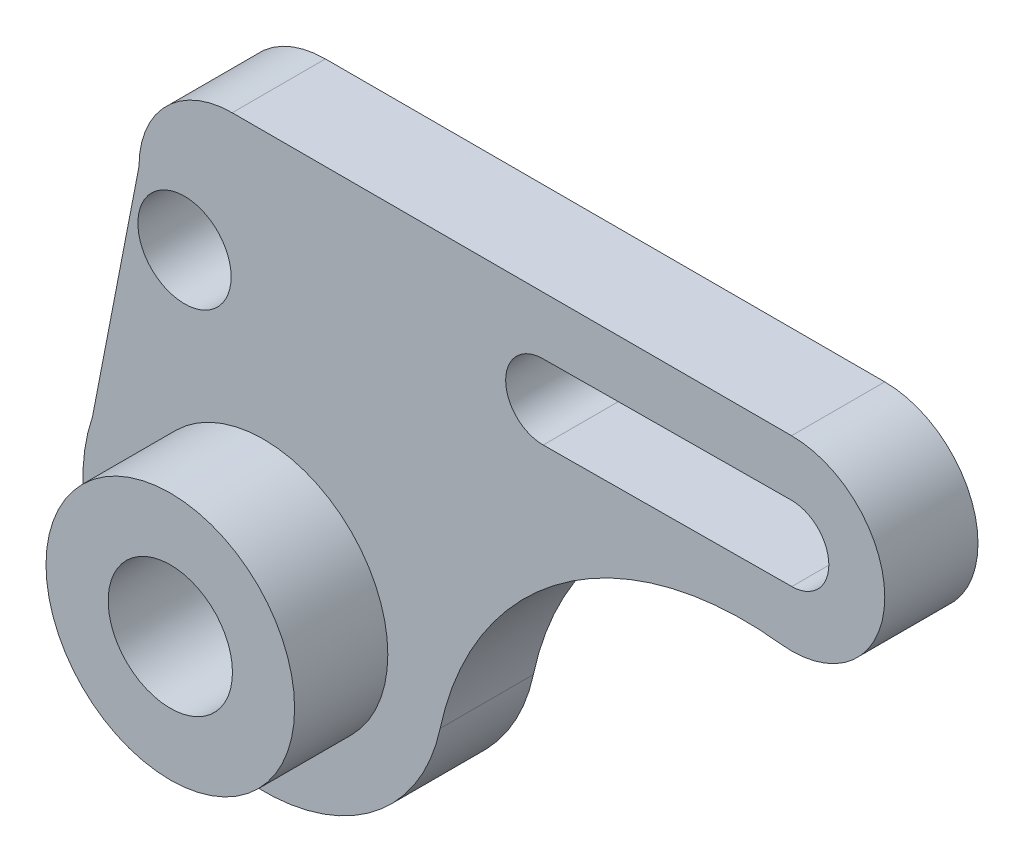
ISO-10303-21;
HEADER;
FILE_DESCRIPTION(('STEP AP214'),'2;1');
FILE_NAME('part.step','',(''),(''),'','','');
FILE_SCHEMA(('AUTOMOTIVE_DESIGN { 1 0 10303 214 1 1 1 1 }'));
ENDSEC;
DATA;
#1=APPLICATION_CONTEXT('core data for automotive mechanical design processes');
#2=APPLICATION_PROTOCOL_DEFINITION('international standard','automotive_design',2000,#1);
#3=PRODUCT_CONTEXT('',#1,'mechanical');
#4=PRODUCT('Part','Part','',(#3));
#5=PRODUCT_RELATED_PRODUCT_CATEGORY('part','',(#4));
#6=PRODUCT_DEFINITION_FORMATION('','',#4);
#7=PRODUCT_DEFINITION_CONTEXT('part definition',#1,'design');
#8=PRODUCT_DEFINITION('design','',#6,#7);
#9=PRODUCT_DEFINITION_SHAPE('','',#8);
#10=(LENGTH_UNIT() NAMED_UNIT(*) SI_UNIT(.MILLI.,.METRE.));
#11=(NAMED_UNIT(*) PLANE_ANGLE_UNIT() SI_UNIT($,.RADIAN.));
#12=(NAMED_UNIT(*) SI_UNIT($,.STERADIAN.) SOLID_ANGLE_UNIT());
#13=UNCERTAINTY_MEASURE_WITH_UNIT(LENGTH_MEASURE(1.E-05),#10,'distance_accuracy_value','');
#14=(GEOMETRIC_REPRESENTATION_CONTEXT(3) GLOBAL_UNCERTAINTY_ASSIGNED_CONTEXT((#13)) GLOBAL_UNIT_ASSIGNED_CONTEXT((#10,
#11,#12)) REPRESENTATION_CONTEXT('',''));
#15=CARTESIAN_POINT('',(0.,0.,0.));
#16=DIRECTION('',(0.,0.,1.));
#17=DIRECTION('',(1.,0.,0.));
#18=AXIS2_PLACEMENT_3D('',#15,#16,#17);
#19=CARTESIAN_POINT('',(0.,0.,50.));
#20=DIRECTION('',(0.,0.,-1.));
#21=DIRECTION('',(-1.,0.,0.));
#22=AXIS2_PLACEMENT_3D('',#19,#20,#21);
#23=CYLINDRICAL_SURFACE('',#22,20.);
#24=CARTESIAN_POINT('',(0.,0.,15.));
#25=DIRECTION('',(0.,0.,1.));
#26=DIRECTION('',(1.,0.,0.));
#27=AXIS2_PLACEMENT_3D('',#24,#25,#26);
#28=CIRCLE('',#27,20.);
#29=CARTESIAN_POINT('',(20.,0.,15.));
#30=VERTEX_POINT('',#29);
#31=EDGE_CURVE('E162',#30,#30,#28,.T.);
#32=ORIENTED_EDGE('',*,*,#31,.T.);
#33=EDGE_LOOP('',(#32));
#34=FACE_BOUND('',#33,.T.);
#35=CARTESIAN_POINT('',(0.,0.,30.));
#36=DIRECTION('',(0.,0.,1.));
#37=DIRECTION('',(1.,0.,0.));
#38=AXIS2_PLACEMENT_3D('',#35,#36,#37);
#39=CIRCLE('',#38,20.);
#40=CARTESIAN_POINT('',(20.,0.,30.));
#41=VERTEX_POINT('',#40);
#42=EDGE_CURVE('E305',#41,#41,#39,.T.);
#43=ORIENTED_EDGE('',*,*,#42,.F.);
#44=EDGE_LOOP('',(#43));
#45=FACE_BOUND('',#44,.T.);
#46=ADVANCED_FACE('F43',(#34,#45),#23,.T.);
#47=CARTESIAN_POINT('',(0.,0.,0.));
#48=DIRECTION('',(0.,0.,1.));
#49=DIRECTION('',(1.,0.,0.));
#50=AXIS2_PLACEMENT_3D('',#47,#48,#49);
#51=CYLINDRICAL_SURFACE('',#50,10.);
#52=CARTESIAN_POINT('',(0.,0.,0.));
#53=DIRECTION('',(0.,0.,1.));
#54=DIRECTION('',(1.,0.,0.));
#55=AXIS2_PLACEMENT_3D('',#52,#53,#54);
#56=CIRCLE('',#55,10.);
#57=CARTESIAN_POINT('',(10.,0.,0.));
#58=VERTEX_POINT('',#57);
#59=EDGE_CURVE('E298',#58,#58,#56,.T.);
#60=ORIENTED_EDGE('',*,*,#59,.F.);
#61=EDGE_LOOP('',(#60));
#62=FACE_BOUND('',#61,.T.);
#63=CARTESIAN_POINT('',(0.,0.,30.));
#64=DIRECTION('',(0.,0.,1.));
#65=DIRECTION('',(1.,0.,0.));
#66=AXIS2_PLACEMENT_3D('',#63,#64,#65);
#67=CIRCLE('',#66,10.);
#68=CARTESIAN_POINT('',(10.,0.,30.));
#69=VERTEX_POINT('',#68);
#70=EDGE_CURVE('E47',#69,#69,#67,.F.);
#71=ORIENTED_EDGE('',*,*,#70,.F.);
#72=EDGE_LOOP('',(#71));
#73=FACE_BOUND('',#72,.T.);
#74=ADVANCED_FACE('F273',(#62,#73),#51,.F.);
#75=CARTESIAN_POINT('',(84.9581360849498,47.9634932344321,15.));
#76=DIRECTION('',(0.,0.,-1.));
#77=DIRECTION('',(-1.,0.,0.));
#78=AXIS2_PLACEMENT_3D('',#75,#76,#77);
#79=CYLINDRICAL_SURFACE('',#78,6.);
#80=CARTESIAN_POINT('',(84.9581360849498,47.9634932344321,0.));
#81=DIRECTION('',(0.,0.,1.));
#82=DIRECTION('',(1.,0.,0.));
#83=AXIS2_PLACEMENT_3D('',#80,#81,#82);
#84=CIRCLE('',#83,6.);
#85=CARTESIAN_POINT('',(85.,41.9636392851583,0.));
#86=VERTEX_POINT('',#85);
#87=CARTESIAN_POINT('',(84.9162721698997,53.963347183706,0.));
#88=VERTEX_POINT('',#87);
#89=EDGE_CURVE('E180',#86,#88,#84,.T.);
#90=ORIENTED_EDGE('',*,*,#89,.F.);
#91=DIRECTION('',(0.,0.,-1.));
#92=VECTOR('',#91,1.);
#93=CARTESIAN_POINT('',(85.,41.9636392851583,15.));
#94=LINE('',#93,#92);
#95=CARTESIAN_POINT('',(85.,41.9636392851583,15.));
#96=VERTEX_POINT('',#95);
#97=EDGE_CURVE('E11',#96,#86,#94,.T.);
#98=ORIENTED_EDGE('',*,*,#97,.F.);
#99=CARTESIAN_POINT('',(84.9581360849498,47.9634932344321,15.));
#100=DIRECTION('',(0.,0.,1.));
#101=DIRECTION('',(1.,0.,0.));
#102=AXIS2_PLACEMENT_3D('',#99,#100,#101);
#103=CIRCLE('',#102,6.);
#104=CARTESIAN_POINT('',(84.9162721698997,53.963347183706,15.));
#105=VERTEX_POINT('',#104);
#106=EDGE_CURVE('E146',#96,#105,#103,.T.);
#107=ORIENTED_EDGE('',*,*,#106,.T.);
#108=DIRECTION('',(0.,0.,-1.));
#109=VECTOR('',#108,1.);
#110=CARTESIAN_POINT('',(84.9162721698997,53.963347183706,15.));
#111=LINE('',#110,#109);
#112=EDGE_CURVE('E103',#105,#88,#111,.T.);
#113=ORIENTED_EDGE('',*,*,#112,.T.);
#114=EDGE_LOOP('',(#90,#98,#107,#113));
#115=FACE_BOUND('',#114,.T.);
#116=ADVANCED_FACE('F259',(#115),#79,.F.);
#117=CARTESIAN_POINT('',(-0.288648524371985,41.3685386765846,15.));
#118=DIRECTION('',(-0.00697731917502474,0.999975658212304,0.));
#119=DIRECTION('',(-0.999975658212304,-0.00697731917502474,0.));
#120=AXIS2_PLACEMENT_3D('',#117,#118,#119);
#121=PLANE('',#120);
#122=DIRECTION('',(0.999975658212304,0.00697731917502474,0.));
#123=VECTOR('',#122,1.);
#124=CARTESIAN_POINT('',(-0.288648524371985,41.3685386765846,0.));
#125=LINE('',#124,#123);
#126=CARTESIAN_POINT('',(45.,41.6845397243751,0.));
#127=VERTEX_POINT('',#126);
#128=EDGE_CURVE('E137',#127,#86,#125,.T.);
#129=ORIENTED_EDGE('',*,*,#128,.F.);
#130=DIRECTION('',(0.,0.,-1.));
#131=VECTOR('',#130,1.);
#132=CARTESIAN_POINT('',(45.,41.6845397243751,15.));
#133=LINE('',#132,#131);
#134=CARTESIAN_POINT('',(45.,41.6845397243751,15.));
#135=VERTEX_POINT('',#134);
#136=EDGE_CURVE('E54',#135,#127,#133,.T.);
#137=ORIENTED_EDGE('',*,*,#136,.F.);
#138=DIRECTION('',(0.999975658212304,0.00697731917502474,0.));
#139=VECTOR('',#138,1.);
#140=CARTESIAN_POINT('',(-0.288648524371985,41.3685386765846,15.));
#141=LINE('',#140,#139);
#142=EDGE_CURVE('E135',#135,#96,#141,.T.);
#143=ORIENTED_EDGE('',*,*,#142,.T.);
#144=ORIENTED_EDGE('',*,*,#97,.T.);
#145=EDGE_LOOP('',(#129,#137,#143,#144));
#146=FACE_BOUND('',#145,.T.);
#147=ADVANCED_FACE('F134',(#146),#121,.T.);
#148=CARTESIAN_POINT('',(44.9581360849499,47.6843936736489,15.));
#149=DIRECTION('',(0.,0.,-1.));
#150=DIRECTION('',(-1.,0.,0.));
#151=AXIS2_PLACEMENT_3D('',#148,#149,#150);
#152=CYLINDRICAL_SURFACE('',#151,6.);
#153=CARTESIAN_POINT('',(44.9581360849499,47.6843936736489,0.));
#154=DIRECTION('',(0.,0.,1.));
#155=DIRECTION('',(1.,0.,0.));
#156=AXIS2_PLACEMENT_3D('',#153,#154,#155);
#157=CIRCLE('',#156,6.);
#158=CARTESIAN_POINT('',(44.9162721698997,53.6842476229227,0.));
#159=VERTEX_POINT('',#158);
#160=EDGE_CURVE('E186',#159,#127,#157,.T.);
#161=ORIENTED_EDGE('',*,*,#160,.F.);
#162=DIRECTION('',(0.,0.,-1.));
#163=VECTOR('',#162,1.);
#164=CARTESIAN_POINT('',(44.9162721698997,53.6842476229227,15.));
#165=LINE('',#164,#163);
#166=CARTESIAN_POINT('',(44.9162721698997,53.6842476229227,15.));
#167=VERTEX_POINT('',#166);
#168=EDGE_CURVE('E96',#167,#159,#165,.T.);
#169=ORIENTED_EDGE('',*,*,#168,.F.);
#170=CARTESIAN_POINT('',(44.9581360849499,47.6843936736489,15.));
#171=DIRECTION('',(0.,0.,1.));
#172=DIRECTION('',(1.,0.,0.));
#173=AXIS2_PLACEMENT_3D('',#170,#171,#172);
#174=CIRCLE('',#173,6.);
#175=EDGE_CURVE('E145',#167,#135,#174,.T.);
#176=ORIENTED_EDGE('',*,*,#175,.T.);
#177=ORIENTED_EDGE('',*,*,#136,.T.);
#178=EDGE_LOOP('',(#161,#169,#176,#177));
#179=FACE_BOUND('',#178,.T.);
#180=ADVANCED_FACE('F149',(#179),#152,.F.);
#181=CARTESIAN_POINT('',(77.3075452454022,-16.584693880357,15.));
#182=DIRECTION('',(0.,0.,-1.));
#183=DIRECTION('',(-1.,0.,0.));
#184=AXIS2_PLACEMENT_3D('',#181,#182,#183);
#185=CYLINDRICAL_SURFACE('',#184,50.);
#186=CARTESIAN_POINT('',(77.3075452454022,-16.584693880357,0.));
#187=DIRECTION('',(0.,0.,1.));
#188=DIRECTION('',(1.,0.,0.));
#189=AXIS2_PLACEMENT_3D('',#186,#187,#188);
#190=CIRCLE('',#189,50.);
#191=CARTESIAN_POINT('',(83.1926151219773,33.0677577464039,0.));
#192=VERTEX_POINT('',#191);
#193=CARTESIAN_POINT('',(28.419860477752,-6.09687818504373,0.));
#194=VERTEX_POINT('',#193);
#195=EDGE_CURVE('E157',#192,#194,#190,.T.);
#196=ORIENTED_EDGE('',*,*,#195,.F.);
#197=DIRECTION('',(0.,0.,-1.));
#198=VECTOR('',#197,1.);
#199=CARTESIAN_POINT('',(83.1926151219773,33.0677577464039,15.));
#200=LINE('',#199,#198);
#201=CARTESIAN_POINT('',(83.1926151219773,33.0677577464039,15.));
#202=VERTEX_POINT('',#201);
#203=EDGE_CURVE('E110',#202,#192,#200,.T.);
#204=ORIENTED_EDGE('',*,*,#203,.F.);
#205=CARTESIAN_POINT('',(77.3075452454022,-16.584693880357,15.));
#206=DIRECTION('',(0.,0.,1.));
#207=DIRECTION('',(1.,0.,0.));
#208=AXIS2_PLACEMENT_3D('',#205,#206,#207);
#209=CIRCLE('',#208,50.);
#210=CARTESIAN_POINT('',(28.419860477752,-6.09687818504373,15.));
#211=VERTEX_POINT('',#210);
#212=EDGE_CURVE('E192',#202,#211,#209,.T.);
#213=ORIENTED_EDGE('',*,*,#212,.T.);
#214=DIRECTION('',(0.,0.,-1.));
#215=VECTOR('',#214,1.);
#216=CARTESIAN_POINT('',(28.419860477752,-6.09687818504373,15.));
#217=LINE('',#216,#215);
#218=EDGE_CURVE('E153',#211,#194,#217,.T.);
#219=ORIENTED_EDGE('',*,*,#218,.T.);
#220=EDGE_LOOP('',(#196,#204,#213,#219));
#221=FACE_BOUND('',#220,.T.);
#222=ADVANCED_FACE('F45',(#221),#185,.F.);
#223=CARTESIAN_POINT('',(84.9581360849498,47.9634932344321,15.));
#224=DIRECTION('',(0.,0.,-1.));
#225=DIRECTION('',(-1.,0.,0.));
#226=AXIS2_PLACEMENT_3D('',#223,#224,#225);
#227=CYLINDRICAL_SURFACE('',#226,15.);
#228=CARTESIAN_POINT('',(84.9581360849498,47.9634932344321,0.));
#229=DIRECTION('',(0.,0.,1.));
#230=DIRECTION('',(1.,0.,0.));
#231=AXIS2_PLACEMENT_3D('',#228,#229,#230);
#232=CIRCLE('',#231,15.);
#233=CARTESIAN_POINT('',(84.9581360849498,62.9634932344321,0.));
#234=VERTEX_POINT('',#233);
#235=EDGE_CURVE('E161',#192,#234,#232,.T.);
#236=ORIENTED_EDGE('',*,*,#235,.T.);
#237=DIRECTION('',(0.,0.,-1.));
#238=VECTOR('',#237,1.);
#239=CARTESIAN_POINT('',(84.9581360849498,62.9634932344321,15.));
#240=LINE('',#239,#238);
#241=CARTESIAN_POINT('',(84.9581360849498,62.9634932344321,15.));
#242=VERTEX_POINT('',#241);
#243=EDGE_CURVE('E210',#242,#234,#240,.T.);
#244=ORIENTED_EDGE('',*,*,#243,.F.);
#245=CARTESIAN_POINT('',(84.9581360849498,47.9634932344321,15.));
#246=DIRECTION('',(0.,0.,1.));
#247=DIRECTION('',(1.,0.,0.));
#248=AXIS2_PLACEMENT_3D('',#245,#246,#247);
#249=CIRCLE('',#248,15.);
#250=EDGE_CURVE('E217',#202,#242,#249,.T.);
#251=ORIENTED_EDGE('',*,*,#250,.F.);
#252=ORIENTED_EDGE('',*,*,#203,.T.);
#253=EDGE_LOOP('',(#236,#244,#251,#252));
#254=FACE_BOUND('',#253,.T.);
#255=ADVANCED_FACE('F215',(#254),#227,.T.);
#256=CARTESIAN_POINT('',(0.,62.9634932344321,15.));
#257=DIRECTION('',(0.,1.,0.));
#258=DIRECTION('',(0.,0.,1.));
#259=AXIS2_PLACEMENT_3D('',#256,#257,#258);
#260=PLANE('',#259);
#261=DIRECTION('',(1.,0.,0.));
#262=VECTOR('',#261,1.);
#263=CARTESIAN_POINT('',(0.,62.9634932344321,0.));
#264=LINE('',#263,#262);
#265=CARTESIAN_POINT('',(-5.04186391505014,62.9634932344321,0.));
#266=VERTEX_POINT('',#265);
#267=EDGE_CURVE('E166',#266,#234,#264,.T.);
#268=ORIENTED_EDGE('',*,*,#267,.F.);
#269=DIRECTION('',(0.,0.,-1.));
#270=VECTOR('',#269,1.);
#271=CARTESIAN_POINT('',(-5.04186391505014,62.9634932344321,15.));
#272=LINE('',#271,#270);
#273=CARTESIAN_POINT('',(-5.04186391505014,62.9634932344321,15.));
#274=VERTEX_POINT('',#273);
#275=EDGE_CURVE('E207',#274,#266,#272,.T.);
#276=ORIENTED_EDGE('',*,*,#275,.F.);
#277=DIRECTION('',(1.,0.,0.));
#278=VECTOR('',#277,1.);
#279=CARTESIAN_POINT('',(0.,62.9634932344321,15.));
#280=LINE('',#279,#278);
#281=EDGE_CURVE('E244',#274,#242,#280,.T.);
#282=ORIENTED_EDGE('',*,*,#281,.T.);
#283=ORIENTED_EDGE('',*,*,#243,.T.);
#284=EDGE_LOOP('',(#268,#276,#282,#283));
#285=FACE_BOUND('',#284,.T.);
#286=ADVANCED_FACE('F243',(#285),#260,.T.);
#287=CARTESIAN_POINT('',(-5.04186391505014,47.9634932344321,15.));
#288=DIRECTION('',(0.,0.,-1.));
#289=DIRECTION('',(-1.,0.,0.));
#290=AXIS2_PLACEMENT_3D('',#287,#288,#289);
#291=CYLINDRICAL_SURFACE('',#290,15.);
#292=CARTESIAN_POINT('',(-5.04186391505014,47.9634932344321,0.));
#293=DIRECTION('',(0.,0.,1.));
#294=DIRECTION('',(1.,0.,0.));
#295=AXIS2_PLACEMENT_3D('',#292,#293,#294);
#296=CIRCLE('',#295,15.);
#297=CARTESIAN_POINT('',(-20.0418639150501,47.9634932344321,0.));
#298=VERTEX_POINT('',#297);
#299=EDGE_CURVE('E170',#266,#298,#296,.T.);
#300=ORIENTED_EDGE('',*,*,#299,.T.);
#301=DIRECTION('',(0.,0.,-1.));
#302=VECTOR('',#301,1.);
#303=CARTESIAN_POINT('',(-20.0418639150501,47.9634932344321,15.));
#304=LINE('',#303,#302);
#305=CARTESIAN_POINT('',(-20.0418639150501,47.9634932344321,15.));
#306=VERTEX_POINT('',#305);
#307=EDGE_CURVE('E203',#306,#298,#304,.T.);
#308=ORIENTED_EDGE('',*,*,#307,.F.);
#309=CARTESIAN_POINT('',(-5.04186391505014,47.9634932344321,15.));
#310=DIRECTION('',(0.,0.,1.));
#311=DIRECTION('',(1.,0.,0.));
#312=AXIS2_PLACEMENT_3D('',#309,#310,#311);
#313=CIRCLE('',#312,15.);
#314=EDGE_CURVE('E239',#274,#306,#313,.T.);
#315=ORIENTED_EDGE('',*,*,#314,.F.);
#316=ORIENTED_EDGE('',*,*,#275,.T.);
#317=EDGE_LOOP('',(#300,#308,#315,#316));
#318=FACE_BOUND('',#317,.T.);
#319=ADVANCED_FACE('F238',(#318),#291,.T.);
#320=CARTESIAN_POINT('',(-28.274150504545,5.47868576814494,15.));
#321=DIRECTION('',(0.981739215628397,-0.190231733675905,0.));
#322=DIRECTION('',(0.190231733675905,0.981739215628397,0.));
#323=AXIS2_PLACEMENT_3D('',#320,#321,#322);
#324=PLANE('',#323);
#325=DIRECTION('',(-0.190231733675905,-0.981739215628397,0.));
#326=VECTOR('',#325,1.);
#327=CARTESIAN_POINT('',(-28.274150504545,5.47868576814494,0.));
#328=LINE('',#327,#326);
#329=CARTESIAN_POINT('',(-27.527219981133,9.33341059251447,0.));
#330=VERTEX_POINT('',#329);
#331=EDGE_CURVE('E173',#298,#330,#328,.T.);
#332=ORIENTED_EDGE('',*,*,#331,.T.);
#333=DIRECTION('',(0.,0.,-1.));
#334=VECTOR('',#333,1.);
#335=CARTESIAN_POINT('',(-27.527219981133,9.33341059251447,15.));
#336=LINE('',#335,#334);
#337=CARTESIAN_POINT('',(-27.527219981133,9.33341059251447,15.));
#338=VERTEX_POINT('',#337);
#339=EDGE_CURVE('E199',#338,#330,#336,.T.);
#340=ORIENTED_EDGE('',*,*,#339,.F.);
#341=DIRECTION('',(-0.190231733675905,-0.981739215628397,0.));
#342=VECTOR('',#341,1.);
#343=CARTESIAN_POINT('',(-28.274150504545,5.47868576814494,15.));
#344=LINE('',#343,#342);
#345=EDGE_CURVE('E235',#306,#338,#344,.T.);
#346=ORIENTED_EDGE('',*,*,#345,.F.);
#347=ORIENTED_EDGE('',*,*,#307,.T.);
#348=EDGE_LOOP('',(#332,#340,#346,#347));
#349=FACE_BOUND('',#348,.T.);
#350=ADVANCED_FACE('F232',(#349),#324,.F.);
#351=CARTESIAN_POINT('',(0.,0.,15.));
#352=DIRECTION('',(0.,0.,-1.));
#353=DIRECTION('',(-1.,0.,0.));
#354=AXIS2_PLACEMENT_3D('',#351,#352,#353);
#355=CYLINDRICAL_SURFACE('',#354,29.0664822979691);
#356=CARTESIAN_POINT('',(0.,0.,0.));
#357=DIRECTION('',(0.,0.,1.));
#358=DIRECTION('',(1.,0.,0.));
#359=AXIS2_PLACEMENT_3D('',#356,#357,#358);
#360=CIRCLE('',#359,29.0664822979691);
#361=EDGE_CURVE('E176',#330,#194,#360,.T.);
#362=ORIENTED_EDGE('',*,*,#361,.T.);
#363=ORIENTED_EDGE('',*,*,#218,.F.);
#364=CARTESIAN_POINT('',(0.,0.,15.));
#365=DIRECTION('',(0.,0.,1.));
#366=DIRECTION('',(1.,0.,0.));
#367=AXIS2_PLACEMENT_3D('',#364,#365,#366);
#368=CIRCLE('',#367,29.0664822979691);
#369=EDGE_CURVE('E256',#338,#211,#368,.T.);
#370=ORIENTED_EDGE('',*,*,#369,.F.);
#371=ORIENTED_EDGE('',*,*,#339,.T.);
#372=EDGE_LOOP('',(#362,#363,#370,#371));
#373=FACE_BOUND('',#372,.T.);
#374=ADVANCED_FACE('F228',(#373),#355,.T.);
#375=CARTESIAN_POINT('',(-0.372376354472282,53.3682465751323,15.));
#376=DIRECTION('',(-0.00697731917502474,0.999975658212304,0.));
#377=DIRECTION('',(-0.999975658212304,-0.00697731917502474,0.));
#378=AXIS2_PLACEMENT_3D('',#375,#376,#377);
#379=PLANE('',#378);
#380=DIRECTION('',(0.999975658212304,0.00697731917502474,0.));
#381=VECTOR('',#380,1.);
#382=CARTESIAN_POINT('',(-0.372376354472282,53.3682465751323,0.));
#383=LINE('',#382,#381);
#384=EDGE_CURVE('E189',#159,#88,#383,.T.);
#385=ORIENTED_EDGE('',*,*,#384,.T.);
#386=ORIENTED_EDGE('',*,*,#112,.F.);
#387=DIRECTION('',(0.999975658212304,0.00697731917502474,0.));
#388=VECTOR('',#387,1.);
#389=CARTESIAN_POINT('',(-0.372376354472282,53.3682465751323,15.));
#390=LINE('',#389,#388);
#391=EDGE_CURVE('E63',#167,#105,#390,.T.);
#392=ORIENTED_EDGE('',*,*,#391,.F.);
#393=ORIENTED_EDGE('',*,*,#168,.T.);
#394=EDGE_LOOP('',(#385,#386,#392,#393));
#395=FACE_BOUND('',#394,.T.);
#396=ADVANCED_FACE('F260',(#395),#379,.F.);
#397=CARTESIAN_POINT('',(0.,0.,15.));
#398=DIRECTION('',(0.,0.,1.));
#399=DIRECTION('',(1.,0.,0.));
#400=AXIS2_PLACEMENT_3D('',#397,#398,#399);
#401=PLANE('',#400);
#402=CARTESIAN_POINT('',(-12.716641071572,40.,15.));
#403=DIRECTION('',(0.,0.,1.));
#404=DIRECTION('',(1.,0.,0.));
#405=AXIS2_PLACEMENT_3D('',#402,#403,#404);
#406=CIRCLE('',#405,7.5);
#407=CARTESIAN_POINT('',(-5.21664107157199,40.,15.));
#408=VERTEX_POINT('',#407);
#409=EDGE_CURVE('E311',#408,#408,#406,.T.);
#410=ORIENTED_EDGE('',*,*,#409,.F.);
#411=EDGE_LOOP('',(#410));
#412=FACE_BOUND('',#411,.T.);
#413=ORIENTED_EDGE('',*,*,#31,.F.);
#414=EDGE_LOOP('',(#413));
#415=FACE_BOUND('',#414,.T.);
#416=ORIENTED_EDGE('',*,*,#212,.F.);
#417=ORIENTED_EDGE('',*,*,#250,.T.);
#418=ORIENTED_EDGE('',*,*,#281,.F.);
#419=ORIENTED_EDGE('',*,*,#314,.T.);
#420=ORIENTED_EDGE('',*,*,#345,.T.);
#421=ORIENTED_EDGE('',*,*,#369,.T.);
#422=EDGE_LOOP('',(#416,#417,#418,#419,#420,#421));
#423=FACE_BOUND('',#422,.T.);
#424=ORIENTED_EDGE('',*,*,#106,.F.);
#425=ORIENTED_EDGE('',*,*,#142,.F.);
#426=ORIENTED_EDGE('',*,*,#175,.F.);
#427=ORIENTED_EDGE('',*,*,#391,.T.);
#428=EDGE_LOOP('',(#424,#425,#426,#427));
#429=FACE_BOUND('',#428,.T.);
#430=ADVANCED_FACE('F144',(#412,#415,#423,#429),#401,.T.);
#431=CARTESIAN_POINT('',(0.,0.,0.));
#432=DIRECTION('',(0.,0.,1.));
#433=DIRECTION('',(1.,0.,0.));
#434=AXIS2_PLACEMENT_3D('',#431,#432,#433);
#435=PLANE('',#434);
#436=CARTESIAN_POINT('',(-12.716641071572,40.,0.));
#437=DIRECTION('',(0.,0.,1.));
#438=DIRECTION('',(1.,0.,0.));
#439=AXIS2_PLACEMENT_3D('',#436,#437,#438);
#440=CIRCLE('',#439,7.5);
#441=CARTESIAN_POINT('',(-5.21664107157199,40.,0.));
#442=VERTEX_POINT('',#441);
#443=EDGE_CURVE('E295',#442,#442,#440,.T.);
#444=ORIENTED_EDGE('',*,*,#443,.T.);
#445=EDGE_LOOP('',(#444));
#446=FACE_BOUND('',#445,.T.);
#447=ORIENTED_EDGE('',*,*,#59,.T.);
#448=EDGE_LOOP('',(#447));
#449=FACE_BOUND('',#448,.T.);
#450=ORIENTED_EDGE('',*,*,#195,.T.);
#451=ORIENTED_EDGE('',*,*,#361,.F.);
#452=ORIENTED_EDGE('',*,*,#331,.F.);
#453=ORIENTED_EDGE('',*,*,#299,.F.);
#454=ORIENTED_EDGE('',*,*,#267,.T.);
#455=ORIENTED_EDGE('',*,*,#235,.F.);
#456=EDGE_LOOP('',(#450,#451,#452,#453,#454,#455));
#457=FACE_BOUND('',#456,.T.);
#458=ORIENTED_EDGE('',*,*,#89,.T.);
#459=ORIENTED_EDGE('',*,*,#384,.F.);
#460=ORIENTED_EDGE('',*,*,#160,.T.);
#461=ORIENTED_EDGE('',*,*,#128,.T.);
#462=EDGE_LOOP('',(#458,#459,#460,#461));
#463=FACE_BOUND('',#462,.T.);
#464=ADVANCED_FACE('F220',(#446,#449,#457,#463),#435,.F.);
#465=CARTESIAN_POINT('',(0.,0.,30.));
#466=DIRECTION('',(0.,0.,1.));
#467=DIRECTION('',(1.,0.,0.));
#468=AXIS2_PLACEMENT_3D('',#465,#466,#467);
#469=PLANE('',#468);
#470=ORIENTED_EDGE('',*,*,#42,.T.);
#471=EDGE_LOOP('',(#470));
#472=FACE_BOUND('',#471,.T.);
#473=ORIENTED_EDGE('',*,*,#70,.T.);
#474=EDGE_LOOP('',(#473));
#475=FACE_BOUND('',#474,.T.);
#476=ADVANCED_FACE('F285',(#472,#475),#469,.T.);
#477=CARTESIAN_POINT('',(-12.716641071572,40.,0.));
#478=DIRECTION('',(0.,0.,1.));
#479=DIRECTION('',(1.,0.,0.));
#480=AXIS2_PLACEMENT_3D('',#477,#478,#479);
#481=CYLINDRICAL_SURFACE('',#480,7.5);
#482=ORIENTED_EDGE('',*,*,#409,.T.);
#483=EDGE_LOOP('',(#482));
#484=FACE_BOUND('',#483,.T.);
#485=ORIENTED_EDGE('',*,*,#443,.F.);
#486=EDGE_LOOP('',(#485));
#487=FACE_BOUND('',#486,.T.);
#488=ADVANCED_FACE('F290',(#484,#487),#481,.F.);
#489=CLOSED_SHELL('',(#46,#74,#116,#147,#180,#222,#255,#286,#319,#350,#374,#396,#430,#464,#476,#488));
#490=MANIFOLD_SOLID_BREP('B2',#489);
#491=ADVANCED_BREP_SHAPE_REPRESENTATION('',(#18,#490),#14);
#492=SHAPE_DEFINITION_REPRESENTATION(#9,#491);
ENDSEC;
END-ISO-10303-21;
